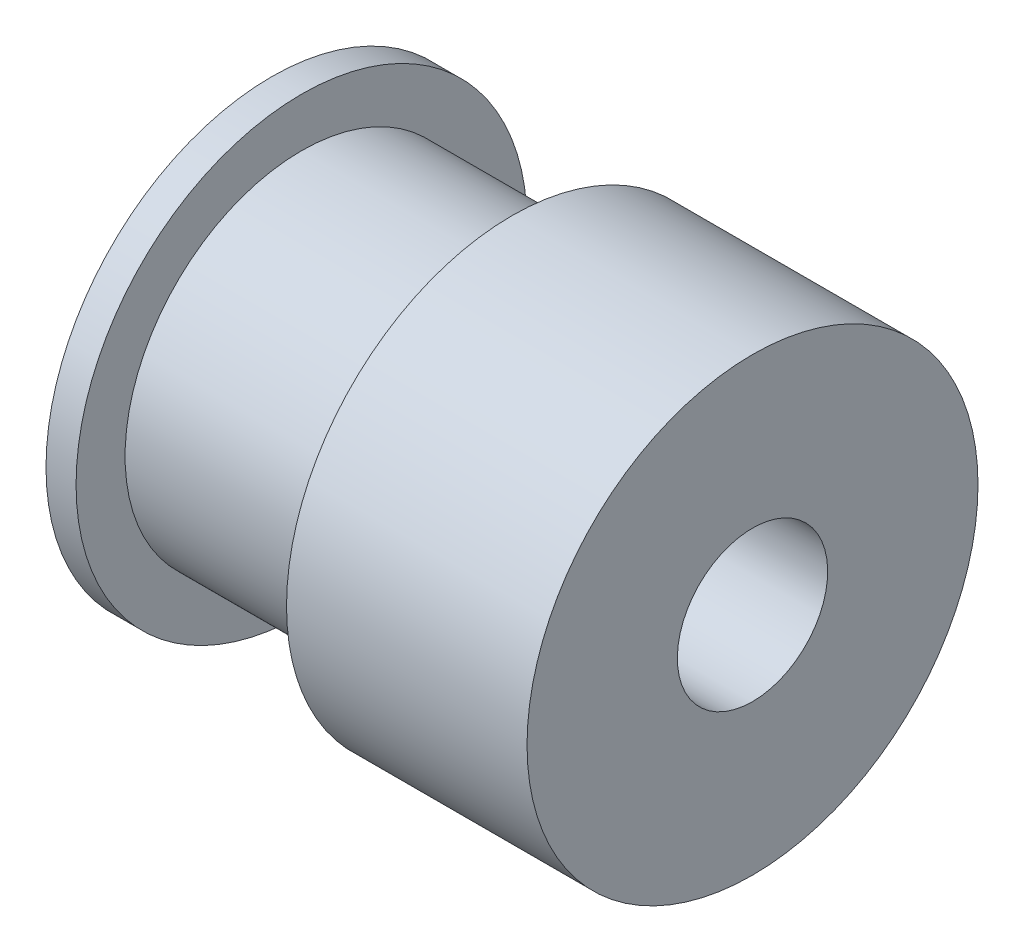
ISO-10303-21;
HEADER;
FILE_DESCRIPTION(('STEP AP214'),'2;1');
FILE_NAME('part.step','',(''),(''),'','','');
FILE_SCHEMA(('AUTOMOTIVE_DESIGN { 1 0 10303 214 1 1 1 1 }'));
ENDSEC;
DATA;
#1=APPLICATION_CONTEXT('core data for automotive mechanical design processes');
#2=APPLICATION_PROTOCOL_DEFINITION('international standard','automotive_design',2000,#1);
#3=PRODUCT_CONTEXT('',#1,'mechanical');
#4=PRODUCT('Part','Part','',(#3));
#5=PRODUCT_RELATED_PRODUCT_CATEGORY('part','',(#4));
#6=PRODUCT_DEFINITION_FORMATION('','',#4);
#7=PRODUCT_DEFINITION_CONTEXT('part definition',#1,'design');
#8=PRODUCT_DEFINITION('design','',#6,#7);
#9=PRODUCT_DEFINITION_SHAPE('','',#8);
#10=(LENGTH_UNIT() NAMED_UNIT(*) SI_UNIT(.MILLI.,.METRE.));
#11=(NAMED_UNIT(*) PLANE_ANGLE_UNIT() SI_UNIT($,.RADIAN.));
#12=(NAMED_UNIT(*) SI_UNIT($,.STERADIAN.) SOLID_ANGLE_UNIT());
#13=UNCERTAINTY_MEASURE_WITH_UNIT(LENGTH_MEASURE(1.E-05),#10,'distance_accuracy_value','');
#14=(GEOMETRIC_REPRESENTATION_CONTEXT(3) GLOBAL_UNCERTAINTY_ASSIGNED_CONTEXT((#13)) GLOBAL_UNIT_ASSIGNED_CONTEXT((#10,
#11,#12)) REPRESENTATION_CONTEXT('',''));
#15=CARTESIAN_POINT('',(0.,0.,0.));
#16=DIRECTION('',(0.,0.,1.));
#17=DIRECTION('',(1.,0.,0.));
#18=AXIS2_PLACEMENT_3D('',#15,#16,#17);
#19=CARTESIAN_POINT('',(0.,0.,0.));
#20=DIRECTION('',(1.,0.,0.));
#21=DIRECTION('',(0.,1.,0.));
#22=AXIS2_PLACEMENT_3D('',#19,#20,#21);
#23=PLANE('',#22);
#24=CARTESIAN_POINT('',(0.,0.,0.));
#25=DIRECTION('',(-1.,0.,0.));
#26=DIRECTION('',(0.,-1.,0.));
#27=AXIS2_PLACEMENT_3D('',#24,#25,#26);
#28=CIRCLE('',#27,2.5);
#29=CARTESIAN_POINT('',(0.,-2.5,0.));
#30=VERTEX_POINT('',#29);
#31=EDGE_CURVE('E64',#30,#30,#28,.T.);
#32=ORIENTED_EDGE('',*,*,#31,.T.);
#33=EDGE_LOOP('',(#32));
#34=FACE_BOUND('',#33,.T.);
#35=CARTESIAN_POINT('',(0.,0.,0.));
#36=DIRECTION('',(1.,0.,0.));
#37=DIRECTION('',(0.,1.,0.));
#38=AXIS2_PLACEMENT_3D('',#35,#36,#37);
#39=CIRCLE('',#38,7.5);
#40=CARTESIAN_POINT('',(0.,7.5,0.));
#41=VERTEX_POINT('',#40);
#42=EDGE_CURVE('E10',#41,#41,#39,.T.);
#43=ORIENTED_EDGE('',*,*,#42,.T.);
#44=EDGE_LOOP('',(#43));
#45=FACE_BOUND('',#44,.T.);
#46=ADVANCED_FACE('F39',(#34,#45),#23,.T.);
#47=CARTESIAN_POINT('',(-7.,0.,0.));
#48=DIRECTION('',(1.,0.,0.));
#49=DIRECTION('',(0.,1.,0.));
#50=AXIS2_PLACEMENT_3D('',#47,#48,#49);
#51=CYLINDRICAL_SURFACE('',#50,7.5);
#52=ORIENTED_EDGE('',*,*,#42,.F.);
#53=EDGE_LOOP('',(#52));
#54=FACE_BOUND('',#53,.T.);
#55=CARTESIAN_POINT('',(-8.,0.,0.));
#56=DIRECTION('',(1.,0.,0.));
#57=DIRECTION('',(0.,1.,0.));
#58=AXIS2_PLACEMENT_3D('',#55,#56,#57);
#59=CIRCLE('',#58,7.5);
#60=CARTESIAN_POINT('',(-8.,7.5,0.));
#61=VERTEX_POINT('',#60);
#62=EDGE_CURVE('E46',#61,#61,#59,.T.);
#63=ORIENTED_EDGE('',*,*,#62,.T.);
#64=EDGE_LOOP('',(#63));
#65=FACE_BOUND('',#64,.T.);
#66=ADVANCED_FACE('F84',(#54,#65),#51,.T.);
#67=CARTESIAN_POINT('',(-8.,0.,0.));
#68=DIRECTION('',(1.,0.,0.));
#69=DIRECTION('',(0.,1.,0.));
#70=AXIS2_PLACEMENT_3D('',#67,#68,#69);
#71=PLANE('',#70);
#72=ORIENTED_EDGE('',*,*,#62,.F.);
#73=EDGE_LOOP('',(#72));
#74=FACE_BOUND('',#73,.T.);
#75=CARTESIAN_POINT('',(-8.,0.,0.));
#76=DIRECTION('',(1.,0.,0.));
#77=DIRECTION('',(0.,1.,0.));
#78=AXIS2_PLACEMENT_3D('',#75,#76,#77);
#79=CIRCLE('',#78,5.87);
#80=CARTESIAN_POINT('',(-8.,5.87,0.));
#81=VERTEX_POINT('',#80);
#82=EDGE_CURVE('E50',#81,#81,#79,.T.);
#83=ORIENTED_EDGE('',*,*,#82,.T.);
#84=EDGE_LOOP('',(#83));
#85=FACE_BOUND('',#84,.T.);
#86=ADVANCED_FACE('F88',(#74,#85),#71,.F.);
#87=CARTESIAN_POINT('',(-7.,0.,0.));
#88=DIRECTION('',(1.,0.,0.));
#89=DIRECTION('',(0.,1.,0.));
#90=AXIS2_PLACEMENT_3D('',#87,#88,#89);
#91=CYLINDRICAL_SURFACE('',#90,5.87);
#92=ORIENTED_EDGE('',*,*,#82,.F.);
#93=EDGE_LOOP('',(#92));
#94=FACE_BOUND('',#93,.T.);
#95=CARTESIAN_POINT('',(-15.,0.,0.));
#96=DIRECTION('',(1.,0.,0.));
#97=DIRECTION('',(0.,1.,0.));
#98=AXIS2_PLACEMENT_3D('',#95,#96,#97);
#99=CIRCLE('',#98,5.87);
#100=CARTESIAN_POINT('',(-15.,5.87,0.));
#101=VERTEX_POINT('',#100);
#102=EDGE_CURVE('E55',#101,#101,#99,.T.);
#103=ORIENTED_EDGE('',*,*,#102,.T.);
#104=EDGE_LOOP('',(#103));
#105=FACE_BOUND('',#104,.T.);
#106=ADVANCED_FACE('F93',(#94,#105),#91,.T.);
#107=CARTESIAN_POINT('',(-15.,0.,0.));
#108=DIRECTION('',(-1.,0.,0.));
#109=DIRECTION('',(0.,-1.,0.));
#110=AXIS2_PLACEMENT_3D('',#107,#108,#109);
#111=PLANE('',#110);
#112=ORIENTED_EDGE('',*,*,#102,.F.);
#113=EDGE_LOOP('',(#112));
#114=FACE_BOUND('',#113,.T.);
#115=CARTESIAN_POINT('',(-15.,0.,0.));
#116=DIRECTION('',(1.,0.,0.));
#117=DIRECTION('',(0.,1.,0.));
#118=AXIS2_PLACEMENT_3D('',#115,#116,#117);
#119=CIRCLE('',#118,7.5);
#120=CARTESIAN_POINT('',(-15.,7.5,0.));
#121=VERTEX_POINT('',#120);
#122=EDGE_CURVE('E58',#121,#121,#119,.T.);
#123=ORIENTED_EDGE('',*,*,#122,.T.);
#124=EDGE_LOOP('',(#123));
#125=FACE_BOUND('',#124,.T.);
#126=ADVANCED_FACE('F100',(#114,#125),#111,.F.);
#127=CARTESIAN_POINT('',(-7.,0.,0.));
#128=DIRECTION('',(1.,0.,0.));
#129=DIRECTION('',(0.,1.,0.));
#130=AXIS2_PLACEMENT_3D('',#127,#128,#129);
#131=CYLINDRICAL_SURFACE('',#130,7.5);
#132=ORIENTED_EDGE('',*,*,#122,.F.);
#133=EDGE_LOOP('',(#132));
#134=FACE_BOUND('',#133,.T.);
#135=CARTESIAN_POINT('',(-16.,0.,0.));
#136=DIRECTION('',(1.,0.,0.));
#137=DIRECTION('',(0.,1.,0.));
#138=AXIS2_PLACEMENT_3D('',#135,#136,#137);
#139=CIRCLE('',#138,7.5);
#140=CARTESIAN_POINT('',(-16.,7.5,0.));
#141=VERTEX_POINT('',#140);
#142=EDGE_CURVE('E61',#141,#141,#139,.T.);
#143=ORIENTED_EDGE('',*,*,#142,.T.);
#144=EDGE_LOOP('',(#143));
#145=FACE_BOUND('',#144,.T.);
#146=ADVANCED_FACE('F81',(#134,#145),#131,.T.);
#147=CARTESIAN_POINT('',(-16.,0.,0.));
#148=DIRECTION('',(1.,0.,0.));
#149=DIRECTION('',(0.,1.,0.));
#150=AXIS2_PLACEMENT_3D('',#147,#148,#149);
#151=PLANE('',#150);
#152=CARTESIAN_POINT('',(-16.,0.,0.));
#153=DIRECTION('',(1.,0.,0.));
#154=DIRECTION('',(0.,1.,0.));
#155=AXIS2_PLACEMENT_3D('',#152,#153,#154);
#156=CIRCLE('',#155,2.5);
#157=CARTESIAN_POINT('',(-16.,2.5,0.));
#158=VERTEX_POINT('',#157);
#159=EDGE_CURVE('E42',#158,#158,#156,.T.);
#160=ORIENTED_EDGE('',*,*,#159,.T.);
#161=EDGE_LOOP('',(#160));
#162=FACE_BOUND('',#161,.T.);
#163=ORIENTED_EDGE('',*,*,#142,.F.);
#164=EDGE_LOOP('',(#163));
#165=FACE_BOUND('',#164,.T.);
#166=ADVANCED_FACE('F71',(#162,#165),#151,.F.);
#167=CARTESIAN_POINT('',(0.,0.,0.));
#168=DIRECTION('',(-1.,0.,0.));
#169=DIRECTION('',(0.,-1.,0.));
#170=AXIS2_PLACEMENT_3D('',#167,#168,#169);
#171=CYLINDRICAL_SURFACE('',#170,2.5);
#172=ORIENTED_EDGE('',*,*,#31,.F.);
#173=EDGE_LOOP('',(#172));
#174=FACE_BOUND('',#173,.T.);
#175=ORIENTED_EDGE('',*,*,#159,.F.);
#176=EDGE_LOOP('',(#175));
#177=FACE_BOUND('',#176,.T.);
#178=ADVANCED_FACE('F74',(#174,#177),#171,.F.);
#179=CLOSED_SHELL('',(#46,#66,#86,#106,#126,#146,#166,#178));
#180=MANIFOLD_SOLID_BREP('B2',#179);
#181=ADVANCED_BREP_SHAPE_REPRESENTATION('',(#18,#180),#14);
#182=SHAPE_DEFINITION_REPRESENTATION(#9,#181);
ENDSEC;
END-ISO-10303-21;
